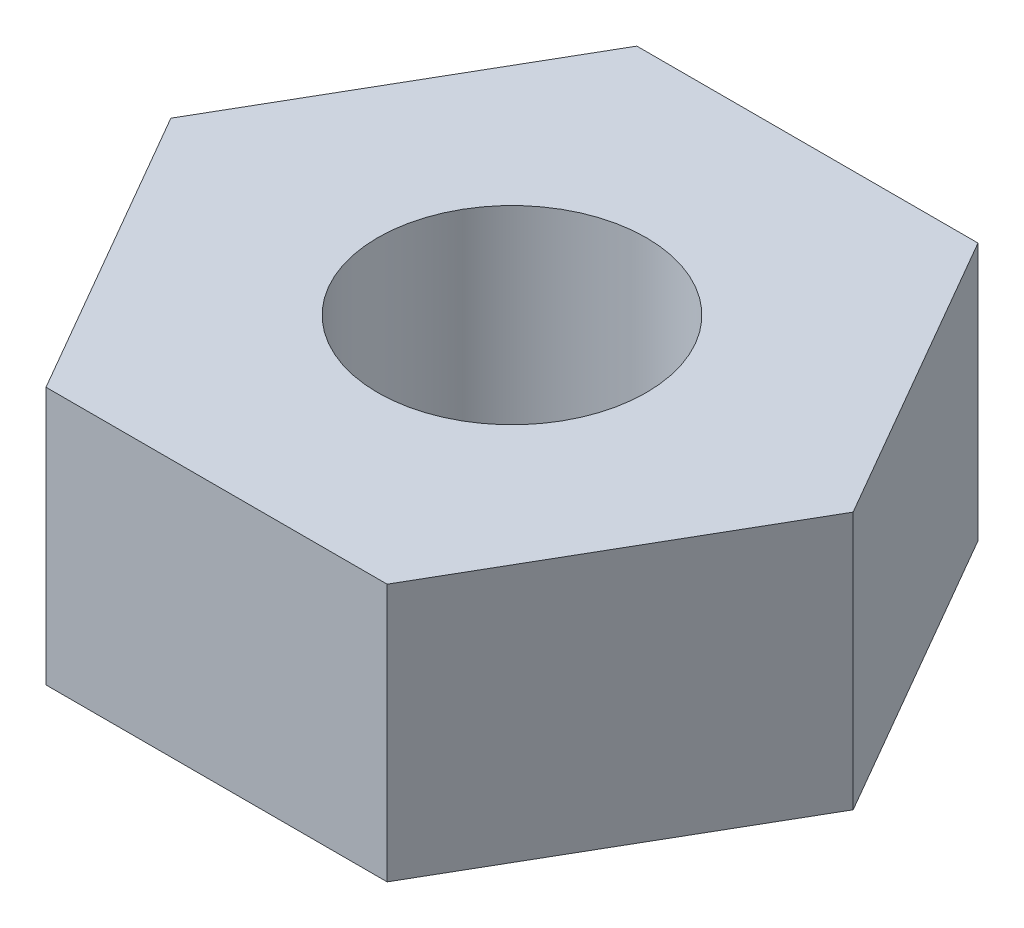
ISO-10303-21;
HEADER;
FILE_DESCRIPTION(('STEP AP214'),'2;1');
FILE_NAME('part.step','',(''),(''),'','','');
FILE_SCHEMA(('AUTOMOTIVE_DESIGN { 1 0 10303 214 1 1 1 1 }'));
ENDSEC;
DATA;
#1=APPLICATION_CONTEXT('core data for automotive mechanical design processes');
#2=APPLICATION_PROTOCOL_DEFINITION('international standard','automotive_design',2000,#1);
#3=PRODUCT_CONTEXT('',#1,'mechanical');
#4=PRODUCT('Part','Part','',(#3));
#5=PRODUCT_RELATED_PRODUCT_CATEGORY('part','',(#4));
#6=PRODUCT_DEFINITION_FORMATION('','',#4);
#7=PRODUCT_DEFINITION_CONTEXT('part definition',#1,'design');
#8=PRODUCT_DEFINITION('design','',#6,#7);
#9=PRODUCT_DEFINITION_SHAPE('','',#8);
#10=(LENGTH_UNIT() NAMED_UNIT(*) SI_UNIT(.MILLI.,.METRE.));
#11=(NAMED_UNIT(*) PLANE_ANGLE_UNIT() SI_UNIT($,.RADIAN.));
#12=(NAMED_UNIT(*) SI_UNIT($,.STERADIAN.) SOLID_ANGLE_UNIT());
#13=UNCERTAINTY_MEASURE_WITH_UNIT(LENGTH_MEASURE(1.E-05),#10,'distance_accuracy_value','');
#14=(GEOMETRIC_REPRESENTATION_CONTEXT(3) GLOBAL_UNCERTAINTY_ASSIGNED_CONTEXT((#13)) GLOBAL_UNIT_ASSIGNED_CONTEXT((#10,
#11,#12)) REPRESENTATION_CONTEXT('',''));
#15=CARTESIAN_POINT('',(0.,0.,0.));
#16=DIRECTION('',(0.,0.,1.));
#17=DIRECTION('',(1.,0.,0.));
#18=AXIS2_PLACEMENT_3D('',#15,#16,#17);
#19=CARTESIAN_POINT('',(-1.58771324027148,2.4,-2.75000000000001));
#20=DIRECTION('',(0.,1.,0.));
#21=DIRECTION('',(0.,0.,1.));
#22=AXIS2_PLACEMENT_3D('',#19,#20,#21);
#23=PLANE('',#22);
#24=DIRECTION('',(-1.,0.,0.));
#25=VECTOR('',#24,1.);
#26=CARTESIAN_POINT('',(1.58771324027146,2.4,-2.75));
#27=LINE('',#26,#25);
#28=CARTESIAN_POINT('',(1.58771324027146,2.4,-2.75));
#29=VERTEX_POINT('',#28);
#30=CARTESIAN_POINT('',(-1.58771324027148,2.4,-2.75000000000001));
#31=VERTEX_POINT('',#30);
#32=EDGE_CURVE('E155',#29,#31,#27,.T.);
#33=ORIENTED_EDGE('',*,*,#32,.T.);
#34=DIRECTION('',(-0.5,0.,0.866025403784439));
#35=VECTOR('',#34,1.);
#36=CARTESIAN_POINT('',(-1.58771324027148,2.4,-2.75000000000001));
#37=LINE('',#36,#35);
#38=CARTESIAN_POINT('',(-3.17542648054295,2.4,0.));
#39=VERTEX_POINT('',#38);
#40=EDGE_CURVE('E103',#31,#39,#37,.T.);
#41=ORIENTED_EDGE('',*,*,#40,.T.);
#42=DIRECTION('',(0.5,0.,0.866025403784438));
#43=VECTOR('',#42,1.);
#44=CARTESIAN_POINT('',(-3.17542648054295,2.4,0.));
#45=LINE('',#44,#43);
#46=CARTESIAN_POINT('',(-1.58771324027148,2.4,2.74999999999999));
#47=VERTEX_POINT('',#46);
#48=EDGE_CURVE('E116',#39,#47,#45,.T.);
#49=ORIENTED_EDGE('',*,*,#48,.T.);
#50=DIRECTION('',(1.,0.,0.));
#51=VECTOR('',#50,1.);
#52=CARTESIAN_POINT('',(-1.58771324027148,2.4,2.74999999999999));
#53=LINE('',#52,#51);
#54=CARTESIAN_POINT('',(1.58771324027147,2.4,2.74999999999999));
#55=VERTEX_POINT('',#54);
#56=EDGE_CURVE('E110',#47,#55,#53,.T.);
#57=ORIENTED_EDGE('',*,*,#56,.T.);
#58=DIRECTION('',(0.500000000000001,0.,-0.866025403784438));
#59=VECTOR('',#58,1.);
#60=CARTESIAN_POINT('',(1.58771324027147,2.4,2.74999999999999));
#61=LINE('',#60,#59);
#62=CARTESIAN_POINT('',(3.17542648054293,2.4,0.));
#63=VERTEX_POINT('',#62);
#64=EDGE_CURVE('E114',#55,#63,#61,.T.);
#65=ORIENTED_EDGE('',*,*,#64,.T.);
#66=DIRECTION('',(-0.5,0.,-0.866025403784439));
#67=VECTOR('',#66,1.);
#68=CARTESIAN_POINT('',(3.17542648054293,2.4,0.));
#69=LINE('',#68,#67);
#70=EDGE_CURVE('E57',#63,#29,#69,.T.);
#71=ORIENTED_EDGE('',*,*,#70,.T.);
#72=EDGE_LOOP('',(#33,#41,#49,#57,#65,#71));
#73=FACE_BOUND('',#72,.T.);
#74=CARTESIAN_POINT('',(0.,2.4,0.));
#75=DIRECTION('',(0.,1.,0.));
#76=DIRECTION('',(0.,0.,1.));
#77=AXIS2_PLACEMENT_3D('',#74,#75,#76);
#78=CIRCLE('',#77,1.25);
#79=CARTESIAN_POINT('',(0.,2.4,1.25));
#80=VERTEX_POINT('',#79);
#81=EDGE_CURVE('E144',#80,#80,#78,.T.);
#82=ORIENTED_EDGE('',*,*,#81,.F.);
#83=EDGE_LOOP('',(#82));
#84=FACE_BOUND('',#83,.T.);
#85=ADVANCED_FACE('F36',(#73,#84),#23,.T.);
#86=CARTESIAN_POINT('',(-1.58771324027148,0.,-2.75000000000001));
#87=DIRECTION('',(0.,1.,0.));
#88=DIRECTION('',(0.,0.,1.));
#89=AXIS2_PLACEMENT_3D('',#86,#87,#88);
#90=PLANE('',#89);
#91=DIRECTION('',(-1.,0.,0.));
#92=VECTOR('',#91,1.);
#93=CARTESIAN_POINT('',(1.58771324027146,0.,-2.75));
#94=LINE('',#93,#92);
#95=CARTESIAN_POINT('',(1.58771324027146,0.,-2.75));
#96=VERTEX_POINT('',#95);
#97=CARTESIAN_POINT('',(-1.58771324027148,0.,-2.75000000000001));
#98=VERTEX_POINT('',#97);
#99=EDGE_CURVE('E140',#96,#98,#94,.T.);
#100=ORIENTED_EDGE('',*,*,#99,.F.);
#101=DIRECTION('',(-0.5,0.,-0.866025403784439));
#102=VECTOR('',#101,1.);
#103=CARTESIAN_POINT('',(3.17542648054293,0.,0.));
#104=LINE('',#103,#102);
#105=CARTESIAN_POINT('',(3.17542648054293,0.,0.));
#106=VERTEX_POINT('',#105);
#107=EDGE_CURVE('E94',#106,#96,#104,.T.);
#108=ORIENTED_EDGE('',*,*,#107,.F.);
#109=DIRECTION('',(0.500000000000001,0.,-0.866025403784438));
#110=VECTOR('',#109,1.);
#111=CARTESIAN_POINT('',(1.58771324027147,0.,2.74999999999999));
#112=LINE('',#111,#110);
#113=CARTESIAN_POINT('',(1.58771324027147,0.,2.74999999999999));
#114=VERTEX_POINT('',#113);
#115=EDGE_CURVE('E86',#114,#106,#112,.T.);
#116=ORIENTED_EDGE('',*,*,#115,.F.);
#117=DIRECTION('',(1.,0.,0.));
#118=VECTOR('',#117,1.);
#119=CARTESIAN_POINT('',(-1.58771324027148,0.,2.74999999999999));
#120=LINE('',#119,#118);
#121=CARTESIAN_POINT('',(-1.58771324027148,0.,2.74999999999999));
#122=VERTEX_POINT('',#121);
#123=EDGE_CURVE('E125',#122,#114,#120,.T.);
#124=ORIENTED_EDGE('',*,*,#123,.F.);
#125=DIRECTION('',(0.5,0.,0.866025403784438));
#126=VECTOR('',#125,1.);
#127=CARTESIAN_POINT('',(-3.17542648054295,0.,0.));
#128=LINE('',#127,#126);
#129=CARTESIAN_POINT('',(-3.17542648054295,0.,0.));
#130=VERTEX_POINT('',#129);
#131=EDGE_CURVE('E146',#130,#122,#128,.T.);
#132=ORIENTED_EDGE('',*,*,#131,.F.);
#133=DIRECTION('',(-0.5,0.,0.866025403784439));
#134=VECTOR('',#133,1.);
#135=CARTESIAN_POINT('',(-1.58771324027148,0.,-2.75000000000001));
#136=LINE('',#135,#134);
#137=EDGE_CURVE('E143',#98,#130,#136,.T.);
#138=ORIENTED_EDGE('',*,*,#137,.F.);
#139=EDGE_LOOP('',(#100,#108,#116,#124,#132,#138));
#140=FACE_BOUND('',#139,.T.);
#141=CARTESIAN_POINT('',(0.,0.,0.));
#142=DIRECTION('',(0.,1.,0.));
#143=DIRECTION('',(0.,0.,1.));
#144=AXIS2_PLACEMENT_3D('',#141,#142,#143);
#145=CIRCLE('',#144,1.25);
#146=CARTESIAN_POINT('',(0.,0.,1.25));
#147=VERTEX_POINT('',#146);
#148=EDGE_CURVE('E254',#147,#147,#145,.T.);
#149=ORIENTED_EDGE('',*,*,#148,.T.);
#150=EDGE_LOOP('',(#149));
#151=FACE_BOUND('',#150,.T.);
#152=ADVANCED_FACE('F170',(#140,#151),#90,.F.);
#153=CARTESIAN_POINT('',(1.58771324027146,2.4,-2.75));
#154=DIRECTION('',(0.,0.,1.));
#155=DIRECTION('',(1.,0.,0.));
#156=AXIS2_PLACEMENT_3D('',#153,#154,#155);
#157=PLANE('',#156);
#158=ORIENTED_EDGE('',*,*,#99,.T.);
#159=DIRECTION('',(0.,-1.,0.));
#160=VECTOR('',#159,1.);
#161=CARTESIAN_POINT('',(-1.58771324027148,2.4,-2.75000000000001));
#162=LINE('',#161,#160);
#163=EDGE_CURVE('E11',#31,#98,#162,.T.);
#164=ORIENTED_EDGE('',*,*,#163,.F.);
#165=ORIENTED_EDGE('',*,*,#32,.F.);
#166=DIRECTION('',(0.,-1.,0.));
#167=VECTOR('',#166,1.);
#168=CARTESIAN_POINT('',(1.58771324027146,2.4,-2.75));
#169=LINE('',#168,#167);
#170=EDGE_CURVE('E136',#29,#96,#169,.T.);
#171=ORIENTED_EDGE('',*,*,#170,.T.);
#172=EDGE_LOOP('',(#158,#164,#165,#171));
#173=FACE_BOUND('',#172,.T.);
#174=ADVANCED_FACE('F38',(#173),#157,.F.);
#175=CARTESIAN_POINT('',(-1.58771324027148,2.4,-2.75000000000001));
#176=DIRECTION('',(0.866025403784439,0.,0.5));
#177=DIRECTION('',(0.5,0.,-0.866025403784439));
#178=AXIS2_PLACEMENT_3D('',#175,#176,#177);
#179=PLANE('',#178);
#180=ORIENTED_EDGE('',*,*,#137,.T.);
#181=DIRECTION('',(0.,-1.,0.));
#182=VECTOR('',#181,1.);
#183=CARTESIAN_POINT('',(-3.17542648054295,2.4,0.));
#184=LINE('',#183,#182);
#185=EDGE_CURVE('E46',#39,#130,#184,.T.);
#186=ORIENTED_EDGE('',*,*,#185,.F.);
#187=ORIENTED_EDGE('',*,*,#40,.F.);
#188=ORIENTED_EDGE('',*,*,#163,.T.);
#189=EDGE_LOOP('',(#180,#186,#187,#188));
#190=FACE_BOUND('',#189,.T.);
#191=ADVANCED_FACE('F195',(#190),#179,.F.);
#192=CARTESIAN_POINT('',(-3.17542648054295,2.4,0.));
#193=DIRECTION('',(0.866025403784438,0.,-0.5));
#194=DIRECTION('',(-0.5,0.,-0.866025403784439));
#195=AXIS2_PLACEMENT_3D('',#192,#193,#194);
#196=PLANE('',#195);
#197=ORIENTED_EDGE('',*,*,#131,.T.);
#198=DIRECTION('',(0.,-1.,0.));
#199=VECTOR('',#198,1.);
#200=CARTESIAN_POINT('',(-1.58771324027148,2.4,2.74999999999999));
#201=LINE('',#200,#199);
#202=EDGE_CURVE('E127',#47,#122,#201,.T.);
#203=ORIENTED_EDGE('',*,*,#202,.F.);
#204=ORIENTED_EDGE('',*,*,#48,.F.);
#205=ORIENTED_EDGE('',*,*,#185,.T.);
#206=EDGE_LOOP('',(#197,#203,#204,#205));
#207=FACE_BOUND('',#206,.T.);
#208=ADVANCED_FACE('F167',(#207),#196,.F.);
#209=CARTESIAN_POINT('',(-1.58771324027148,2.4,2.74999999999999));
#210=DIRECTION('',(0.,0.,-1.));
#211=DIRECTION('',(-1.,0.,0.));
#212=AXIS2_PLACEMENT_3D('',#209,#210,#211);
#213=PLANE('',#212);
#214=ORIENTED_EDGE('',*,*,#123,.T.);
#215=DIRECTION('',(0.,-1.,0.));
#216=VECTOR('',#215,1.);
#217=CARTESIAN_POINT('',(1.58771324027147,2.4,2.74999999999999));
#218=LINE('',#217,#216);
#219=EDGE_CURVE('E122',#55,#114,#218,.T.);
#220=ORIENTED_EDGE('',*,*,#219,.F.);
#221=ORIENTED_EDGE('',*,*,#56,.F.);
#222=ORIENTED_EDGE('',*,*,#202,.T.);
#223=EDGE_LOOP('',(#214,#220,#221,#222));
#224=FACE_BOUND('',#223,.T.);
#225=ADVANCED_FACE('F123',(#224),#213,.F.);
#226=CARTESIAN_POINT('',(1.58771324027147,2.4,2.74999999999999));
#227=DIRECTION('',(-0.866025403784438,0.,-0.500000000000001));
#228=DIRECTION('',(-0.500000000000001,0.,0.866025403784438));
#229=AXIS2_PLACEMENT_3D('',#226,#227,#228);
#230=PLANE('',#229);
#231=ORIENTED_EDGE('',*,*,#115,.T.);
#232=DIRECTION('',(0.,-1.,0.));
#233=VECTOR('',#232,1.);
#234=CARTESIAN_POINT('',(3.17542648054293,2.4,0.));
#235=LINE('',#234,#233);
#236=EDGE_CURVE('E128',#63,#106,#235,.T.);
#237=ORIENTED_EDGE('',*,*,#236,.F.);
#238=ORIENTED_EDGE('',*,*,#64,.F.);
#239=ORIENTED_EDGE('',*,*,#219,.T.);
#240=EDGE_LOOP('',(#231,#237,#238,#239));
#241=FACE_BOUND('',#240,.T.);
#242=ADVANCED_FACE('F130',(#241),#230,.F.);
#243=CARTESIAN_POINT('',(3.17542648054293,2.4,0.));
#244=DIRECTION('',(-0.866025403784439,0.,0.5));
#245=DIRECTION('',(0.5,0.,0.866025403784439));
#246=AXIS2_PLACEMENT_3D('',#243,#244,#245);
#247=PLANE('',#246);
#248=ORIENTED_EDGE('',*,*,#107,.T.);
#249=ORIENTED_EDGE('',*,*,#170,.F.);
#250=ORIENTED_EDGE('',*,*,#70,.F.);
#251=ORIENTED_EDGE('',*,*,#236,.T.);
#252=EDGE_LOOP('',(#248,#249,#250,#251));
#253=FACE_BOUND('',#252,.T.);
#254=ADVANCED_FACE('F175',(#253),#247,.F.);
#255=CARTESIAN_POINT('',(0.,2.4,0.));
#256=DIRECTION('',(0.,-1.,0.));
#257=DIRECTION('',(0.,0.,-1.));
#258=AXIS2_PLACEMENT_3D('',#255,#256,#257);
#259=CYLINDRICAL_SURFACE('',#258,1.25);
#260=ORIENTED_EDGE('',*,*,#81,.T.);
#261=EDGE_LOOP('',(#260));
#262=FACE_BOUND('',#261,.T.);
#263=ORIENTED_EDGE('',*,*,#148,.F.);
#264=EDGE_LOOP('',(#263));
#265=FACE_BOUND('',#264,.T.);
#266=ADVANCED_FACE('F177',(#262,#265),#259,.F.);
#267=CLOSED_SHELL('',(#85,#152,#174,#191,#208,#225,#242,#254,#266));
#268=MANIFOLD_SOLID_BREP('B2',#267);
#269=ADVANCED_BREP_SHAPE_REPRESENTATION('',(#18,#268),#14);
#270=SHAPE_DEFINITION_REPRESENTATION(#9,#269);
ENDSEC;
END-ISO-10303-21;
